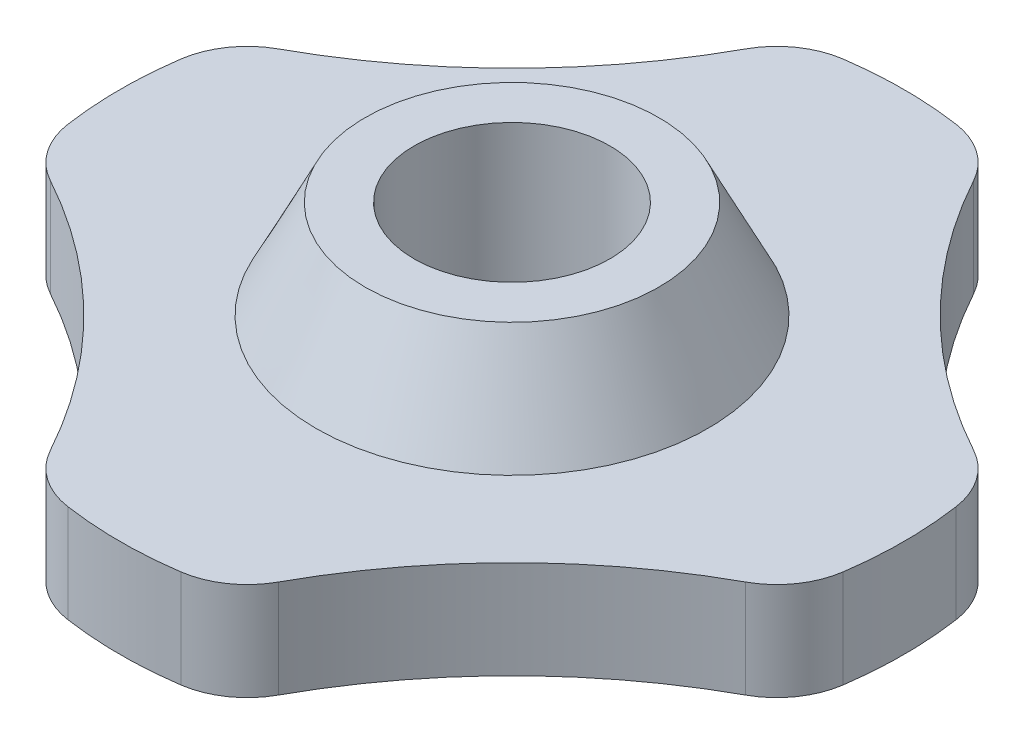
ISO-10303-21;
HEADER;
FILE_DESCRIPTION(('STEP AP214'),'2;1');
FILE_NAME('part.step','',(''),(''),'','','');
FILE_SCHEMA(('AUTOMOTIVE_DESIGN { 1 0 10303 214 1 1 1 1 }'));
ENDSEC;
DATA;
#1=APPLICATION_CONTEXT('core data for automotive mechanical design processes');
#2=APPLICATION_PROTOCOL_DEFINITION('international standard','automotive_design',2000,#1);
#3=PRODUCT_CONTEXT('',#1,'mechanical');
#4=PRODUCT('Part','Part','',(#3));
#5=PRODUCT_RELATED_PRODUCT_CATEGORY('part','',(#4));
#6=PRODUCT_DEFINITION_FORMATION('','',#4);
#7=PRODUCT_DEFINITION_CONTEXT('part definition',#1,'design');
#8=PRODUCT_DEFINITION('design','',#6,#7);
#9=PRODUCT_DEFINITION_SHAPE('','',#8);
#10=(LENGTH_UNIT() NAMED_UNIT(*) SI_UNIT(.MILLI.,.METRE.));
#11=(NAMED_UNIT(*) PLANE_ANGLE_UNIT() SI_UNIT($,.RADIAN.));
#12=(NAMED_UNIT(*) SI_UNIT($,.STERADIAN.) SOLID_ANGLE_UNIT());
#13=UNCERTAINTY_MEASURE_WITH_UNIT(LENGTH_MEASURE(1.E-05),#10,'distance_accuracy_value','');
#14=(GEOMETRIC_REPRESENTATION_CONTEXT(3) GLOBAL_UNCERTAINTY_ASSIGNED_CONTEXT((#13)) GLOBAL_UNIT_ASSIGNED_CONTEXT((#10,
#11,#12)) REPRESENTATION_CONTEXT('',''));
#15=CARTESIAN_POINT('',(0.,0.,0.));
#16=DIRECTION('',(0.,0.,1.));
#17=DIRECTION('',(1.,0.,0.));
#18=AXIS2_PLACEMENT_3D('',#15,#16,#17);
#19=CARTESIAN_POINT('',(0.,3.175,0.));
#20=DIRECTION('',(0.,1.,0.));
#21=DIRECTION('',(0.,0.,1.));
#22=AXIS2_PLACEMENT_3D('',#19,#20,#21);
#23=PLANE('',#22);
#24=CARTESIAN_POINT('',(0.,3.175,0.));
#25=DIRECTION('',(0.,1.,0.));
#26=DIRECTION('',(0.,0.,1.));
#27=AXIS2_PLACEMENT_3D('',#24,#25,#26);
#28=CIRCLE('',#27,12.7);
#29=CARTESIAN_POINT('',(12.566901950679,3.175,1.83384169491787));
#30=VERTEX_POINT('',#29);
#31=CARTESIAN_POINT('',(12.566901950679,3.175,-1.8338416949181));
#32=VERTEX_POINT('',#31);
#33=EDGE_CURVE('E294',#30,#32,#28,.T.);
#34=ORIENTED_EDGE('',*,*,#33,.T.);
#35=CARTESIAN_POINT('',(10.0535215605432,3.175,-1.46707335593448));
#36=DIRECTION('',(0.,1.,0.));
#37=DIRECTION('',(0.,0.,1.));
#38=AXIS2_PLACEMENT_3D('',#35,#36,#37);
#39=CIRCLE('',#38,2.54);
#40=CARTESIAN_POINT('',(11.2720050397584,3.175,-3.69572721216243));
#41=VERTEX_POINT('',#40);
#42=EDGE_CURVE('E226',#32,#41,#39,.T.);
#43=ORIENTED_EDGE('',*,*,#42,.T.);
#44=CARTESIAN_POINT('',(20.4106311338722,3.175,-20.410631133872));
#45=DIRECTION('',(0.,1.,0.));
#46=DIRECTION('',(0.,0.,1.));
#47=AXIS2_PLACEMENT_3D('',#44,#45,#46);
#48=CIRCLE('',#47,19.05);
#49=CARTESIAN_POINT('',(3.69572721216251,3.175,-11.2720050397584));
#50=VERTEX_POINT('',#49);
#51=EDGE_CURVE('E181',#41,#50,#48,.F.);
#52=ORIENTED_EDGE('',*,*,#51,.T.);
#53=CARTESIAN_POINT('',(1.46707335593455,3.175,-10.0535215605432));
#54=DIRECTION('',(0.,1.,0.));
#55=DIRECTION('',(0.,0.,1.));
#56=AXIS2_PLACEMENT_3D('',#53,#54,#55);
#57=CIRCLE('',#56,2.54);
#58=CARTESIAN_POINT('',(1.83384169491819,3.175,-12.566901950679));
#59=VERTEX_POINT('',#58);
#60=EDGE_CURVE('E215',#50,#59,#57,.T.);
#61=ORIENTED_EDGE('',*,*,#60,.T.);
#62=CARTESIAN_POINT('',(0.,3.175,0.));
#63=DIRECTION('',(0.,1.,0.));
#64=DIRECTION('',(0.,0.,1.));
#65=AXIS2_PLACEMENT_3D('',#62,#63,#64);
#66=CIRCLE('',#65,12.7);
#67=CARTESIAN_POINT('',(-1.83384169491815,3.175,-12.566901950679));
#68=VERTEX_POINT('',#67);
#69=EDGE_CURVE('E192',#59,#68,#66,.T.);
#70=ORIENTED_EDGE('',*,*,#69,.T.);
#71=CARTESIAN_POINT('',(-1.46707335593452,3.175,-10.0535215605432));
#72=DIRECTION('',(0.,1.,0.));
#73=DIRECTION('',(0.,0.,1.));
#74=AXIS2_PLACEMENT_3D('',#71,#72,#73);
#75=CIRCLE('',#74,2.54);
#76=CARTESIAN_POINT('',(-3.69572721216247,3.175,-11.2720050397584));
#77=VERTEX_POINT('',#76);
#78=EDGE_CURVE('E213',#68,#77,#75,.T.);
#79=ORIENTED_EDGE('',*,*,#78,.T.);
#80=CARTESIAN_POINT('',(-20.4106311338721,3.175,-20.4106311338721));
#81=DIRECTION('',(0.,1.,0.));
#82=DIRECTION('',(0.,0.,1.));
#83=AXIS2_PLACEMENT_3D('',#80,#81,#82);
#84=CIRCLE('',#83,19.05);
#85=CARTESIAN_POINT('',(-11.2720050397584,3.175,-3.69572721216247));
#86=VERTEX_POINT('',#85);
#87=EDGE_CURVE('E308',#77,#86,#84,.F.);
#88=ORIENTED_EDGE('',*,*,#87,.T.);
#89=CARTESIAN_POINT('',(-10.0535215605432,3.175,-1.46707335593452));
#90=DIRECTION('',(0.,1.,0.));
#91=DIRECTION('',(0.,0.,1.));
#92=AXIS2_PLACEMENT_3D('',#89,#90,#91);
#93=CIRCLE('',#92,2.54);
#94=CARTESIAN_POINT('',(-12.566901950679,3.175,-1.83384169491815));
#95=VERTEX_POINT('',#94);
#96=EDGE_CURVE('E217',#86,#95,#93,.T.);
#97=ORIENTED_EDGE('',*,*,#96,.T.);
#98=CARTESIAN_POINT('',(0.,3.175,0.));
#99=DIRECTION('',(0.,1.,0.));
#100=DIRECTION('',(0.,0.,1.));
#101=AXIS2_PLACEMENT_3D('',#98,#99,#100);
#102=CIRCLE('',#101,12.7);
#103=CARTESIAN_POINT('',(-12.566901950679,3.175,1.83384169491801));
#104=VERTEX_POINT('',#103);
#105=EDGE_CURVE('E305',#95,#104,#102,.T.);
#106=ORIENTED_EDGE('',*,*,#105,.T.);
#107=CARTESIAN_POINT('',(-10.0535215605432,3.175,1.46707335593441));
#108=DIRECTION('',(0.,1.,0.));
#109=DIRECTION('',(0.,0.,1.));
#110=AXIS2_PLACEMENT_3D('',#107,#108,#109);
#111=CIRCLE('',#110,2.54);
#112=CARTESIAN_POINT('',(-11.2720050397584,3.175,3.69572721216234));
#113=VERTEX_POINT('',#112);
#114=EDGE_CURVE('E219',#104,#113,#111,.T.);
#115=ORIENTED_EDGE('',*,*,#114,.T.);
#116=CARTESIAN_POINT('',(-20.4106311338723,3.175,20.4106311338719));
#117=DIRECTION('',(0.,1.,0.));
#118=DIRECTION('',(0.,0.,1.));
#119=AXIS2_PLACEMENT_3D('',#116,#117,#118);
#120=CIRCLE('',#119,19.05);
#121=CARTESIAN_POINT('',(-3.69572721216258,3.175,11.2720050397583));
#122=VERTEX_POINT('',#121);
#123=EDGE_CURVE('E302',#113,#122,#120,.F.);
#124=ORIENTED_EDGE('',*,*,#123,.T.);
#125=CARTESIAN_POINT('',(-1.46707335593462,3.175,10.0535215605432));
#126=DIRECTION('',(0.,1.,0.));
#127=DIRECTION('',(0.,0.,1.));
#128=AXIS2_PLACEMENT_3D('',#125,#126,#127);
#129=CIRCLE('',#128,2.54);
#130=CARTESIAN_POINT('',(-1.83384169491827,3.175,12.566901950679));
#131=VERTEX_POINT('',#130);
#132=EDGE_CURVE('E221',#122,#131,#129,.T.);
#133=ORIENTED_EDGE('',*,*,#132,.T.);
#134=CARTESIAN_POINT('',(0.,3.175,0.));
#135=DIRECTION('',(0.,1.,0.));
#136=DIRECTION('',(0.,0.,1.));
#137=AXIS2_PLACEMENT_3D('',#134,#135,#136);
#138=CIRCLE('',#137,12.7);
#139=CARTESIAN_POINT('',(1.83384169491842,3.175,12.566901950679));
#140=VERTEX_POINT('',#139);
#141=EDGE_CURVE('E298',#131,#140,#138,.T.);
#142=ORIENTED_EDGE('',*,*,#141,.T.);
#143=CARTESIAN_POINT('',(1.46707335593473,3.175,10.0535215605432));
#144=DIRECTION('',(0.,1.,0.));
#145=DIRECTION('',(0.,0.,1.));
#146=AXIS2_PLACEMENT_3D('',#143,#144,#145);
#147=CIRCLE('',#146,2.54);
#148=CARTESIAN_POINT('',(3.6957272121627,3.175,11.2720050397583));
#149=VERTEX_POINT('',#148);
#150=EDGE_CURVE('E68',#140,#149,#147,.T.);
#151=ORIENTED_EDGE('',*,*,#150,.T.);
#152=CARTESIAN_POINT('',(20.4106311338728,3.175,20.4106311338719));
#153=DIRECTION('',(0.,1.,0.));
#154=DIRECTION('',(0.,0.,1.));
#155=AXIS2_PLACEMENT_3D('',#152,#153,#154);
#156=CIRCLE('',#155,19.0500000000004);
#157=CARTESIAN_POINT('',(11.2720050397585,3.175,3.69572721216222));
#158=VERTEX_POINT('',#157);
#159=EDGE_CURVE('E295',#149,#158,#156,.F.);
#160=ORIENTED_EDGE('',*,*,#159,.T.);
#161=CARTESIAN_POINT('',(10.0535215605432,3.175,1.4670733559343));
#162=DIRECTION('',(0.,1.,0.));
#163=DIRECTION('',(0.,0.,1.));
#164=AXIS2_PLACEMENT_3D('',#161,#162,#163);
#165=CIRCLE('',#164,2.54);
#166=EDGE_CURVE('E224',#158,#30,#165,.T.);
#167=ORIENTED_EDGE('',*,*,#166,.T.);
#168=EDGE_LOOP('',(#34,#43,#52,#61,#70,#79,#88,#97,#106,#115,#124,#133,#142,#151,#160,#167));
#169=FACE_BOUND('',#168,.T.);
#170=CARTESIAN_POINT('',(0.,3.175,0.));
#171=DIRECTION('',(0.,1.,0.));
#172=DIRECTION('',(0.,0.,1.));
#173=AXIS2_PLACEMENT_3D('',#170,#171,#172);
#174=CIRCLE('',#173,6.35);
#175=CARTESIAN_POINT('',(0.,3.175,6.35));
#176=VERTEX_POINT('',#175);
#177=EDGE_CURVE('E266',#176,#176,#174,.F.);
#178=ORIENTED_EDGE('',*,*,#177,.T.);
#179=EDGE_LOOP('',(#178));
#180=FACE_BOUND('',#179,.T.);
#181=ADVANCED_FACE('F45',(#169,#180),#23,.T.);
#182=CARTESIAN_POINT('',(0.,3.175,0.));
#183=DIRECTION('',(0.,-1.,0.));
#184=DIRECTION('',(0.,0.,-1.));
#185=AXIS2_PLACEMENT_3D('',#182,#183,#184);
#186=CYLINDRICAL_SURFACE('',#185,12.7);
#187=ORIENTED_EDGE('',*,*,#69,.F.);
#188=DIRECTION('',(0.,-1.,0.));
#189=VECTOR('',#188,1.);
#190=CARTESIAN_POINT('',(1.83384169491819,3.175,-12.566901950679));
#191=LINE('',#190,#189);
#192=CARTESIAN_POINT('',(1.83384169491819,0.,-12.566901950679));
#193=VERTEX_POINT('',#192);
#194=EDGE_CURVE('E54',#59,#193,#191,.T.);
#195=ORIENTED_EDGE('',*,*,#194,.T.);
#196=CARTESIAN_POINT('',(0.,0.,0.));
#197=DIRECTION('',(0.,1.,0.));
#198=DIRECTION('',(0.,0.,1.));
#199=AXIS2_PLACEMENT_3D('',#196,#197,#198);
#200=CIRCLE('',#199,12.7);
#201=CARTESIAN_POINT('',(-1.83384169491815,0.,-12.566901950679));
#202=VERTEX_POINT('',#201);
#203=EDGE_CURVE('E259',#193,#202,#200,.T.);
#204=ORIENTED_EDGE('',*,*,#203,.T.);
#205=DIRECTION('',(0.,-1.,0.));
#206=VECTOR('',#205,1.);
#207=CARTESIAN_POINT('',(-1.83384169491815,3.175,-12.566901950679));
#208=LINE('',#207,#206);
#209=EDGE_CURVE('E252',#202,#68,#208,.F.);
#210=ORIENTED_EDGE('',*,*,#209,.T.);
#211=EDGE_LOOP('',(#187,#195,#204,#210));
#212=FACE_BOUND('',#211,.T.);
#213=ADVANCED_FACE('F258',(#212),#186,.T.);
#214=CARTESIAN_POINT('',(-20.4106311338721,3.175,-20.4106311338721));
#215=DIRECTION('',(0.,-1.,0.));
#216=DIRECTION('',(0.,0.,-1.));
#217=AXIS2_PLACEMENT_3D('',#214,#215,#216);
#218=CYLINDRICAL_SURFACE('',#217,19.05);
#219=CARTESIAN_POINT('',(-20.4106311338721,0.,-20.4106311338721));
#220=DIRECTION('',(0.,1.,0.));
#221=DIRECTION('',(0.,0.,1.));
#222=AXIS2_PLACEMENT_3D('',#219,#220,#221);
#223=CIRCLE('',#222,19.05);
#224=CARTESIAN_POINT('',(-3.69572721216247,0.,-11.2720050397584));
#225=VERTEX_POINT('',#224);
#226=CARTESIAN_POINT('',(-11.2720050397584,0.,-3.69572721216247));
#227=VERTEX_POINT('',#226);
#228=EDGE_CURVE('E265',#225,#227,#223,.F.);
#229=ORIENTED_EDGE('',*,*,#228,.T.);
#230=DIRECTION('',(0.,-1.,0.));
#231=VECTOR('',#230,1.);
#232=CARTESIAN_POINT('',(-11.2720050397584,3.175,-3.69572721216247));
#233=LINE('',#232,#231);
#234=EDGE_CURVE('E250',#227,#86,#233,.F.);
#235=ORIENTED_EDGE('',*,*,#234,.T.);
#236=ORIENTED_EDGE('',*,*,#87,.F.);
#237=DIRECTION('',(0.,-1.,0.));
#238=VECTOR('',#237,1.);
#239=CARTESIAN_POINT('',(-3.69572721216247,3.175,-11.2720050397584));
#240=LINE('',#239,#238);
#241=EDGE_CURVE('E247',#77,#225,#240,.T.);
#242=ORIENTED_EDGE('',*,*,#241,.T.);
#243=EDGE_LOOP('',(#229,#235,#236,#242));
#244=FACE_BOUND('',#243,.T.);
#245=ADVANCED_FACE('F336',(#244),#218,.F.);
#246=CARTESIAN_POINT('',(0.,3.175,0.));
#247=DIRECTION('',(0.,-1.,0.));
#248=DIRECTION('',(0.,0.,-1.));
#249=AXIS2_PLACEMENT_3D('',#246,#247,#248);
#250=CYLINDRICAL_SURFACE('',#249,12.7);
#251=CARTESIAN_POINT('',(0.,0.,0.));
#252=DIRECTION('',(0.,1.,0.));
#253=DIRECTION('',(0.,0.,1.));
#254=AXIS2_PLACEMENT_3D('',#251,#252,#253);
#255=CIRCLE('',#254,12.7);
#256=CARTESIAN_POINT('',(-12.566901950679,0.,-1.83384169491815));
#257=VERTEX_POINT('',#256);
#258=CARTESIAN_POINT('',(-12.566901950679,0.,1.83384169491801));
#259=VERTEX_POINT('',#258);
#260=EDGE_CURVE('E269',#257,#259,#255,.T.);
#261=ORIENTED_EDGE('',*,*,#260,.T.);
#262=DIRECTION('',(0.,-1.,0.));
#263=VECTOR('',#262,1.);
#264=CARTESIAN_POINT('',(-12.566901950679,3.175,1.83384169491801));
#265=LINE('',#264,#263);
#266=EDGE_CURVE('E245',#259,#104,#265,.F.);
#267=ORIENTED_EDGE('',*,*,#266,.T.);
#268=ORIENTED_EDGE('',*,*,#105,.F.);
#269=DIRECTION('',(0.,-1.,0.));
#270=VECTOR('',#269,1.);
#271=CARTESIAN_POINT('',(-12.566901950679,3.175,-1.83384169491815));
#272=LINE('',#271,#270);
#273=EDGE_CURVE('E242',#95,#257,#272,.T.);
#274=ORIENTED_EDGE('',*,*,#273,.T.);
#275=EDGE_LOOP('',(#261,#267,#268,#274));
#276=FACE_BOUND('',#275,.T.);
#277=ADVANCED_FACE('F354',(#276),#250,.T.);
#278=CARTESIAN_POINT('',(-20.4106311338723,3.175,20.4106311338719));
#279=DIRECTION('',(0.,-1.,0.));
#280=DIRECTION('',(0.,0.,-1.));
#281=AXIS2_PLACEMENT_3D('',#278,#279,#280);
#282=CYLINDRICAL_SURFACE('',#281,19.05);
#283=CARTESIAN_POINT('',(-20.4106311338723,0.,20.4106311338719));
#284=DIRECTION('',(0.,1.,0.));
#285=DIRECTION('',(0.,0.,1.));
#286=AXIS2_PLACEMENT_3D('',#283,#284,#285);
#287=CIRCLE('',#286,19.05);
#288=CARTESIAN_POINT('',(-11.2720050397584,0.,3.69572721216234));
#289=VERTEX_POINT('',#288);
#290=CARTESIAN_POINT('',(-3.69572721216258,0.,11.2720050397583));
#291=VERTEX_POINT('',#290);
#292=EDGE_CURVE('E279',#289,#291,#287,.F.);
#293=ORIENTED_EDGE('',*,*,#292,.T.);
#294=DIRECTION('',(0.,-1.,0.));
#295=VECTOR('',#294,1.);
#296=CARTESIAN_POINT('',(-3.69572721216258,3.175,11.2720050397583));
#297=LINE('',#296,#295);
#298=EDGE_CURVE('E240',#291,#122,#297,.F.);
#299=ORIENTED_EDGE('',*,*,#298,.T.);
#300=ORIENTED_EDGE('',*,*,#123,.F.);
#301=DIRECTION('',(0.,-1.,0.));
#302=VECTOR('',#301,1.);
#303=CARTESIAN_POINT('',(-11.2720050397584,3.175,3.69572721216234));
#304=LINE('',#303,#302);
#305=EDGE_CURVE('E237',#113,#289,#304,.T.);
#306=ORIENTED_EDGE('',*,*,#305,.T.);
#307=EDGE_LOOP('',(#293,#299,#300,#306));
#308=FACE_BOUND('',#307,.T.);
#309=ADVANCED_FACE('F350',(#308),#282,.F.);
#310=CARTESIAN_POINT('',(0.,3.175,0.));
#311=DIRECTION('',(0.,-1.,0.));
#312=DIRECTION('',(0.,0.,-1.));
#313=AXIS2_PLACEMENT_3D('',#310,#311,#312);
#314=CYLINDRICAL_SURFACE('',#313,12.7);
#315=CARTESIAN_POINT('',(0.,0.,0.));
#316=DIRECTION('',(0.,1.,0.));
#317=DIRECTION('',(0.,0.,1.));
#318=AXIS2_PLACEMENT_3D('',#315,#316,#317);
#319=CIRCLE('',#318,12.7);
#320=CARTESIAN_POINT('',(-1.83384169491827,0.,12.566901950679));
#321=VERTEX_POINT('',#320);
#322=CARTESIAN_POINT('',(1.83384169491842,0.,12.566901950679));
#323=VERTEX_POINT('',#322);
#324=EDGE_CURVE('E282',#321,#323,#319,.T.);
#325=ORIENTED_EDGE('',*,*,#324,.T.);
#326=DIRECTION('',(0.,-1.,0.));
#327=VECTOR('',#326,1.);
#328=CARTESIAN_POINT('',(1.83384169491842,3.175,12.566901950679));
#329=LINE('',#328,#327);
#330=EDGE_CURVE('E235',#323,#140,#329,.F.);
#331=ORIENTED_EDGE('',*,*,#330,.T.);
#332=ORIENTED_EDGE('',*,*,#141,.F.);
#333=DIRECTION('',(0.,-1.,0.));
#334=VECTOR('',#333,1.);
#335=CARTESIAN_POINT('',(-1.83384169491827,3.175,12.566901950679));
#336=LINE('',#335,#334);
#337=EDGE_CURVE('E232',#131,#321,#336,.T.);
#338=ORIENTED_EDGE('',*,*,#337,.T.);
#339=EDGE_LOOP('',(#325,#331,#332,#338));
#340=FACE_BOUND('',#339,.T.);
#341=ADVANCED_FACE('F347',(#340),#314,.T.);
#342=CARTESIAN_POINT('',(20.4106311338728,3.175,20.4106311338719));
#343=DIRECTION('',(0.,-1.,0.));
#344=DIRECTION('',(0.,0.,-1.));
#345=AXIS2_PLACEMENT_3D('',#342,#343,#344);
#346=CYLINDRICAL_SURFACE('',#345,19.0500000000004);
#347=CARTESIAN_POINT('',(20.4106311338728,0.,20.4106311338719));
#348=DIRECTION('',(0.,1.,0.));
#349=DIRECTION('',(0.,0.,1.));
#350=AXIS2_PLACEMENT_3D('',#347,#348,#349);
#351=CIRCLE('',#350,19.0500000000004);
#352=CARTESIAN_POINT('',(3.6957272121627,0.,11.2720050397583));
#353=VERTEX_POINT('',#352);
#354=CARTESIAN_POINT('',(11.2720050397585,0.,3.69572721216222));
#355=VERTEX_POINT('',#354);
#356=EDGE_CURVE('E194',#353,#355,#351,.F.);
#357=ORIENTED_EDGE('',*,*,#356,.T.);
#358=DIRECTION('',(0.,-1.,0.));
#359=VECTOR('',#358,1.);
#360=CARTESIAN_POINT('',(11.2720050397585,3.175,3.69572721216221));
#361=LINE('',#360,#359);
#362=EDGE_CURVE('E61',#355,#158,#361,.F.);
#363=ORIENTED_EDGE('',*,*,#362,.T.);
#364=ORIENTED_EDGE('',*,*,#159,.F.);
#365=DIRECTION('',(0.,-1.,0.));
#366=VECTOR('',#365,1.);
#367=CARTESIAN_POINT('',(3.6957272121627,3.175,11.2720050397583));
#368=LINE('',#367,#366);
#369=EDGE_CURVE('E228',#149,#353,#368,.T.);
#370=ORIENTED_EDGE('',*,*,#369,.T.);
#371=EDGE_LOOP('',(#357,#363,#364,#370));
#372=FACE_BOUND('',#371,.T.);
#373=ADVANCED_FACE('F285',(#372),#346,.F.);
#374=CARTESIAN_POINT('',(0.,3.175,0.));
#375=DIRECTION('',(0.,-1.,0.));
#376=DIRECTION('',(0.,0.,-1.));
#377=AXIS2_PLACEMENT_3D('',#374,#375,#376);
#378=CYLINDRICAL_SURFACE('',#377,12.7);
#379=CARTESIAN_POINT('',(0.,0.,0.));
#380=DIRECTION('',(0.,1.,0.));
#381=DIRECTION('',(0.,0.,1.));
#382=AXIS2_PLACEMENT_3D('',#379,#380,#381);
#383=CIRCLE('',#382,12.7);
#384=CARTESIAN_POINT('',(12.566901950679,0.,1.83384169491787));
#385=VERTEX_POINT('',#384);
#386=CARTESIAN_POINT('',(12.566901950679,0.,-1.8338416949181));
#387=VERTEX_POINT('',#386);
#388=EDGE_CURVE('E189',#385,#387,#383,.T.);
#389=ORIENTED_EDGE('',*,*,#388,.T.);
#390=DIRECTION('',(0.,-1.,0.));
#391=VECTOR('',#390,1.);
#392=CARTESIAN_POINT('',(12.566901950679,3.175,-1.8338416949181));
#393=LINE('',#392,#391);
#394=EDGE_CURVE('E166',#387,#32,#393,.F.);
#395=ORIENTED_EDGE('',*,*,#394,.T.);
#396=ORIENTED_EDGE('',*,*,#33,.F.);
#397=DIRECTION('',(0.,-1.,0.));
#398=VECTOR('',#397,1.);
#399=CARTESIAN_POINT('',(12.566901950679,3.175,1.83384169491787));
#400=LINE('',#399,#398);
#401=EDGE_CURVE('E171',#30,#385,#400,.T.);
#402=ORIENTED_EDGE('',*,*,#401,.T.);
#403=EDGE_LOOP('',(#389,#395,#396,#402));
#404=FACE_BOUND('',#403,.T.);
#405=ADVANCED_FACE('F297',(#404),#378,.T.);
#406=CARTESIAN_POINT('',(20.4106311338722,3.175,-20.410631133872));
#407=DIRECTION('',(0.,-1.,0.));
#408=DIRECTION('',(0.,0.,-1.));
#409=AXIS2_PLACEMENT_3D('',#406,#407,#408);
#410=CYLINDRICAL_SURFACE('',#409,19.05);
#411=ORIENTED_EDGE('',*,*,#51,.F.);
#412=DIRECTION('',(0.,-1.,0.));
#413=VECTOR('',#412,1.);
#414=CARTESIAN_POINT('',(11.2720050397584,3.175,-3.69572721216243));
#415=LINE('',#414,#413);
#416=CARTESIAN_POINT('',(11.2720050397584,0.,-3.69572721216243));
#417=VERTEX_POINT('',#416);
#418=EDGE_CURVE('E165',#41,#417,#415,.T.);
#419=ORIENTED_EDGE('',*,*,#418,.T.);
#420=CARTESIAN_POINT('',(20.4106311338722,0.,-20.410631133872));
#421=DIRECTION('',(0.,1.,0.));
#422=DIRECTION('',(0.,0.,1.));
#423=AXIS2_PLACEMENT_3D('',#420,#421,#422);
#424=CIRCLE('',#423,19.05);
#425=CARTESIAN_POINT('',(3.69572721216251,0.,-11.2720050397584));
#426=VERTEX_POINT('',#425);
#427=EDGE_CURVE('E178',#417,#426,#424,.F.);
#428=ORIENTED_EDGE('',*,*,#427,.T.);
#429=DIRECTION('',(0.,-1.,0.));
#430=VECTOR('',#429,1.);
#431=CARTESIAN_POINT('',(3.69572721216251,3.175,-11.2720050397584));
#432=LINE('',#431,#430);
#433=EDGE_CURVE('E183',#426,#50,#432,.F.);
#434=ORIENTED_EDGE('',*,*,#433,.T.);
#435=EDGE_LOOP('',(#411,#419,#428,#434));
#436=FACE_BOUND('',#435,.T.);
#437=ADVANCED_FACE('F177',(#436),#410,.F.);
#438=CARTESIAN_POINT('',(0.,3.175,0.));
#439=DIRECTION('',(0.,-1.,0.));
#440=DIRECTION('',(0.,0.,-1.));
#441=AXIS2_PLACEMENT_3D('',#438,#439,#440);
#442=CYLINDRICAL_SURFACE('',#441,3.175);
#443=CARTESIAN_POINT('',(0.,0.,0.));
#444=DIRECTION('',(0.,1.,0.));
#445=DIRECTION('',(0.,0.,1.));
#446=AXIS2_PLACEMENT_3D('',#443,#444,#445);
#447=CIRCLE('',#446,3.175);
#448=CARTESIAN_POINT('',(0.,0.,3.175));
#449=VERTEX_POINT('',#448);
#450=EDGE_CURVE('E188',#449,#449,#447,.T.);
#451=ORIENTED_EDGE('',*,*,#450,.F.);
#452=EDGE_LOOP('',(#451));
#453=FACE_BOUND('',#452,.T.);
#454=CARTESIAN_POINT('',(0.,6.35,0.));
#455=DIRECTION('',(0.,1.,0.));
#456=DIRECTION('',(0.,0.,1.));
#457=AXIS2_PLACEMENT_3D('',#454,#455,#456);
#458=CIRCLE('',#457,3.175);
#459=CARTESIAN_POINT('',(0.,6.35,3.175));
#460=VERTEX_POINT('',#459);
#461=EDGE_CURVE('E272',#460,#460,#458,.T.);
#462=ORIENTED_EDGE('',*,*,#461,.T.);
#463=EDGE_LOOP('',(#462));
#464=FACE_BOUND('',#463,.T.);
#465=ADVANCED_FACE('F315',(#453,#464),#442,.F.);
#466=CARTESIAN_POINT('',(0.,0.,0.));
#467=DIRECTION('',(0.,1.,0.));
#468=DIRECTION('',(0.,0.,1.));
#469=AXIS2_PLACEMENT_3D('',#466,#467,#468);
#470=PLANE('',#469);
#471=ORIENTED_EDGE('',*,*,#450,.T.);
#472=EDGE_LOOP('',(#471));
#473=FACE_BOUND('',#472,.T.);
#474=ORIENTED_EDGE('',*,*,#427,.F.);
#475=CARTESIAN_POINT('',(10.0535215605432,0.,-1.46707335593448));
#476=DIRECTION('',(0.,1.,0.));
#477=DIRECTION('',(0.,0.,1.));
#478=AXIS2_PLACEMENT_3D('',#475,#476,#477);
#479=CIRCLE('',#478,2.54);
#480=EDGE_CURVE('E161',#417,#387,#479,.F.);
#481=ORIENTED_EDGE('',*,*,#480,.T.);
#482=ORIENTED_EDGE('',*,*,#388,.F.);
#483=CARTESIAN_POINT('',(10.0535215605432,0.,1.4670733559343));
#484=DIRECTION('',(0.,1.,0.));
#485=DIRECTION('',(0.,0.,1.));
#486=AXIS2_PLACEMENT_3D('',#483,#484,#485);
#487=CIRCLE('',#486,2.54);
#488=EDGE_CURVE('E172',#385,#355,#487,.F.);
#489=ORIENTED_EDGE('',*,*,#488,.T.);
#490=ORIENTED_EDGE('',*,*,#356,.F.);
#491=CARTESIAN_POINT('',(1.46707335593473,0.,10.0535215605432));
#492=DIRECTION('',(0.,1.,0.));
#493=DIRECTION('',(0.,0.,1.));
#494=AXIS2_PLACEMENT_3D('',#491,#492,#493);
#495=CIRCLE('',#494,2.54);
#496=EDGE_CURVE('E207',#353,#323,#495,.F.);
#497=ORIENTED_EDGE('',*,*,#496,.T.);
#498=ORIENTED_EDGE('',*,*,#324,.F.);
#499=CARTESIAN_POINT('',(-1.46707335593462,0.,10.0535215605432));
#500=DIRECTION('',(0.,1.,0.));
#501=DIRECTION('',(0.,0.,1.));
#502=AXIS2_PLACEMENT_3D('',#499,#500,#501);
#503=CIRCLE('',#502,2.54);
#504=EDGE_CURVE('E205',#321,#291,#503,.F.);
#505=ORIENTED_EDGE('',*,*,#504,.T.);
#506=ORIENTED_EDGE('',*,*,#292,.F.);
#507=CARTESIAN_POINT('',(-10.0535215605432,0.,1.46707335593441));
#508=DIRECTION('',(0.,1.,0.));
#509=DIRECTION('',(0.,0.,1.));
#510=AXIS2_PLACEMENT_3D('',#507,#508,#509);
#511=CIRCLE('',#510,2.54);
#512=EDGE_CURVE('E203',#289,#259,#511,.F.);
#513=ORIENTED_EDGE('',*,*,#512,.T.);
#514=ORIENTED_EDGE('',*,*,#260,.F.);
#515=CARTESIAN_POINT('',(-10.0535215605432,0.,-1.46707335593452));
#516=DIRECTION('',(0.,1.,0.));
#517=DIRECTION('',(0.,0.,1.));
#518=AXIS2_PLACEMENT_3D('',#515,#516,#517);
#519=CIRCLE('',#518,2.54);
#520=EDGE_CURVE('E201',#257,#227,#519,.F.);
#521=ORIENTED_EDGE('',*,*,#520,.T.);
#522=ORIENTED_EDGE('',*,*,#228,.F.);
#523=CARTESIAN_POINT('',(-1.46707335593452,0.,-10.0535215605432));
#524=DIRECTION('',(0.,1.,0.));
#525=DIRECTION('',(0.,0.,1.));
#526=AXIS2_PLACEMENT_3D('',#523,#524,#525);
#527=CIRCLE('',#526,2.54);
#528=EDGE_CURVE('E182',#225,#202,#527,.F.);
#529=ORIENTED_EDGE('',*,*,#528,.T.);
#530=ORIENTED_EDGE('',*,*,#203,.F.);
#531=CARTESIAN_POINT('',(1.46707335593455,0.,-10.0535215605432));
#532=DIRECTION('',(0.,1.,0.));
#533=DIRECTION('',(0.,0.,1.));
#534=AXIS2_PLACEMENT_3D('',#531,#532,#533);
#535=CIRCLE('',#534,2.54);
#536=EDGE_CURVE('E187',#193,#426,#535,.F.);
#537=ORIENTED_EDGE('',*,*,#536,.T.);
#538=EDGE_LOOP('',(#474,#481,#482,#489,#490,#497,#498,#505,#506,#513,#514,#521,#522,#529,#530,#537));
#539=FACE_BOUND('',#538,.T.);
#540=ADVANCED_FACE('F185',(#473,#539),#470,.F.);
#541=CARTESIAN_POINT('',(0.,6.35,0.));
#542=DIRECTION('',(0.,1.,0.));
#543=DIRECTION('',(0.,0.,1.));
#544=AXIS2_PLACEMENT_3D('',#541,#542,#543);
#545=PLANE('',#544);
#546=CARTESIAN_POINT('',(0.,6.35,0.));
#547=DIRECTION('',(0.,1.,0.));
#548=DIRECTION('',(0.,0.,1.));
#549=AXIS2_PLACEMENT_3D('',#546,#547,#548);
#550=CIRCLE('',#549,4.76249999999999);
#551=CARTESIAN_POINT('',(0.,6.35,4.76249999999999));
#552=VERTEX_POINT('',#551);
#553=EDGE_CURVE('E11',#552,#552,#550,.T.);
#554=ORIENTED_EDGE('',*,*,#553,.T.);
#555=EDGE_LOOP('',(#554));
#556=FACE_BOUND('',#555,.T.);
#557=ORIENTED_EDGE('',*,*,#461,.F.);
#558=EDGE_LOOP('',(#557));
#559=FACE_BOUND('',#558,.T.);
#560=ADVANCED_FACE('F317',(#556,#559),#545,.T.);
#561=CARTESIAN_POINT('',(10.0535215605432,3.175,-1.46707335593448));
#562=DIRECTION('',(0.,1.,0.));
#563=DIRECTION('',(0.,0.,1.));
#564=AXIS2_PLACEMENT_3D('',#561,#562,#563);
#565=CYLINDRICAL_SURFACE('',#564,2.54);
#566=ORIENTED_EDGE('',*,*,#42,.F.);
#567=ORIENTED_EDGE('',*,*,#394,.F.);
#568=ORIENTED_EDGE('',*,*,#480,.F.);
#569=ORIENTED_EDGE('',*,*,#418,.F.);
#570=EDGE_LOOP('',(#566,#567,#568,#569));
#571=FACE_BOUND('',#570,.T.);
#572=ADVANCED_FACE('F164',(#571),#565,.T.);
#573=CARTESIAN_POINT('',(10.0535215605432,3.175,1.4670733559343));
#574=DIRECTION('',(0.,1.,0.));
#575=DIRECTION('',(0.,0.,1.));
#576=AXIS2_PLACEMENT_3D('',#573,#574,#575);
#577=CYLINDRICAL_SURFACE('',#576,2.54);
#578=ORIENTED_EDGE('',*,*,#166,.F.);
#579=ORIENTED_EDGE('',*,*,#362,.F.);
#580=ORIENTED_EDGE('',*,*,#488,.F.);
#581=ORIENTED_EDGE('',*,*,#401,.F.);
#582=EDGE_LOOP('',(#578,#579,#580,#581));
#583=FACE_BOUND('',#582,.T.);
#584=ADVANCED_FACE('F289',(#583),#577,.T.);
#585=CARTESIAN_POINT('',(1.46707335593473,3.175,10.0535215605432));
#586=DIRECTION('',(0.,1.,0.));
#587=DIRECTION('',(0.,0.,1.));
#588=AXIS2_PLACEMENT_3D('',#585,#586,#587);
#589=CYLINDRICAL_SURFACE('',#588,2.54);
#590=ORIENTED_EDGE('',*,*,#150,.F.);
#591=ORIENTED_EDGE('',*,*,#330,.F.);
#592=ORIENTED_EDGE('',*,*,#496,.F.);
#593=ORIENTED_EDGE('',*,*,#369,.F.);
#594=EDGE_LOOP('',(#590,#591,#592,#593));
#595=FACE_BOUND('',#594,.T.);
#596=ADVANCED_FACE('F364',(#595),#589,.T.);
#597=CARTESIAN_POINT('',(-1.46707335593462,3.175,10.0535215605432));
#598=DIRECTION('',(0.,1.,0.));
#599=DIRECTION('',(0.,0.,1.));
#600=AXIS2_PLACEMENT_3D('',#597,#598,#599);
#601=CYLINDRICAL_SURFACE('',#600,2.54);
#602=ORIENTED_EDGE('',*,*,#132,.F.);
#603=ORIENTED_EDGE('',*,*,#298,.F.);
#604=ORIENTED_EDGE('',*,*,#504,.F.);
#605=ORIENTED_EDGE('',*,*,#337,.F.);
#606=EDGE_LOOP('',(#602,#603,#604,#605));
#607=FACE_BOUND('',#606,.T.);
#608=ADVANCED_FACE('F367',(#607),#601,.T.);
#609=CARTESIAN_POINT('',(-10.0535215605432,3.175,1.46707335593441));
#610=DIRECTION('',(0.,1.,0.));
#611=DIRECTION('',(0.,0.,1.));
#612=AXIS2_PLACEMENT_3D('',#609,#610,#611);
#613=CYLINDRICAL_SURFACE('',#612,2.54);
#614=ORIENTED_EDGE('',*,*,#114,.F.);
#615=ORIENTED_EDGE('',*,*,#266,.F.);
#616=ORIENTED_EDGE('',*,*,#512,.F.);
#617=ORIENTED_EDGE('',*,*,#305,.F.);
#618=EDGE_LOOP('',(#614,#615,#616,#617));
#619=FACE_BOUND('',#618,.T.);
#620=ADVANCED_FACE('F371',(#619),#613,.T.);
#621=CARTESIAN_POINT('',(-10.0535215605432,3.175,-1.46707335593452));
#622=DIRECTION('',(0.,1.,0.));
#623=DIRECTION('',(0.,0.,1.));
#624=AXIS2_PLACEMENT_3D('',#621,#622,#623);
#625=CYLINDRICAL_SURFACE('',#624,2.54);
#626=ORIENTED_EDGE('',*,*,#96,.F.);
#627=ORIENTED_EDGE('',*,*,#234,.F.);
#628=ORIENTED_EDGE('',*,*,#520,.F.);
#629=ORIENTED_EDGE('',*,*,#273,.F.);
#630=EDGE_LOOP('',(#626,#627,#628,#629));
#631=FACE_BOUND('',#630,.T.);
#632=ADVANCED_FACE('F375',(#631),#625,.T.);
#633=CARTESIAN_POINT('',(1.46707335593455,3.175,-10.0535215605432));
#634=DIRECTION('',(0.,1.,0.));
#635=DIRECTION('',(0.,0.,1.));
#636=AXIS2_PLACEMENT_3D('',#633,#634,#635);
#637=CYLINDRICAL_SURFACE('',#636,2.54);
#638=ORIENTED_EDGE('',*,*,#60,.F.);
#639=ORIENTED_EDGE('',*,*,#433,.F.);
#640=ORIENTED_EDGE('',*,*,#536,.F.);
#641=ORIENTED_EDGE('',*,*,#194,.F.);
#642=EDGE_LOOP('',(#638,#639,#640,#641));
#643=FACE_BOUND('',#642,.T.);
#644=ADVANCED_FACE('F379',(#643),#637,.T.);
#645=CARTESIAN_POINT('',(-1.46707335593452,3.175,-10.0535215605432));
#646=DIRECTION('',(0.,1.,0.));
#647=DIRECTION('',(0.,0.,1.));
#648=AXIS2_PLACEMENT_3D('',#645,#646,#647);
#649=CYLINDRICAL_SURFACE('',#648,2.54);
#650=ORIENTED_EDGE('',*,*,#78,.F.);
#651=ORIENTED_EDGE('',*,*,#209,.F.);
#652=ORIENTED_EDGE('',*,*,#528,.F.);
#653=ORIENTED_EDGE('',*,*,#241,.F.);
#654=EDGE_LOOP('',(#650,#651,#652,#653));
#655=FACE_BOUND('',#654,.T.);
#656=ADVANCED_FACE('F382',(#655),#649,.T.);
#657=CARTESIAN_POINT('',(0.,6.35,0.));
#658=DIRECTION('',(0.,-1.,0.));
#659=DIRECTION('',(0.,0.,-1.));
#660=AXIS2_PLACEMENT_3D('',#657,#658,#659);
#661=CONICAL_SURFACE('',#660,4.76249999999999,0.463647609000804);
#662=ORIENTED_EDGE('',*,*,#177,.F.);
#663=EDGE_LOOP('',(#662));
#664=FACE_BOUND('',#663,.T.);
#665=ORIENTED_EDGE('',*,*,#553,.F.);
#666=EDGE_LOOP('',(#665));
#667=FACE_BOUND('',#666,.T.);
#668=ADVANCED_FACE('F48',(#664,#667),#661,.T.);
#669=CLOSED_SHELL('',(#181,#213,#245,#277,#309,#341,#373,#405,#437,#465,#540,#560,#572,#584,
#596,#608,#620,#632,#644,#656,#668));
#670=MANIFOLD_SOLID_BREP('B2',#669);
#671=ADVANCED_BREP_SHAPE_REPRESENTATION('',(#18,#670),#14);
#672=SHAPE_DEFINITION_REPRESENTATION(#9,#671);
ENDSEC;
END-ISO-10303-21;
